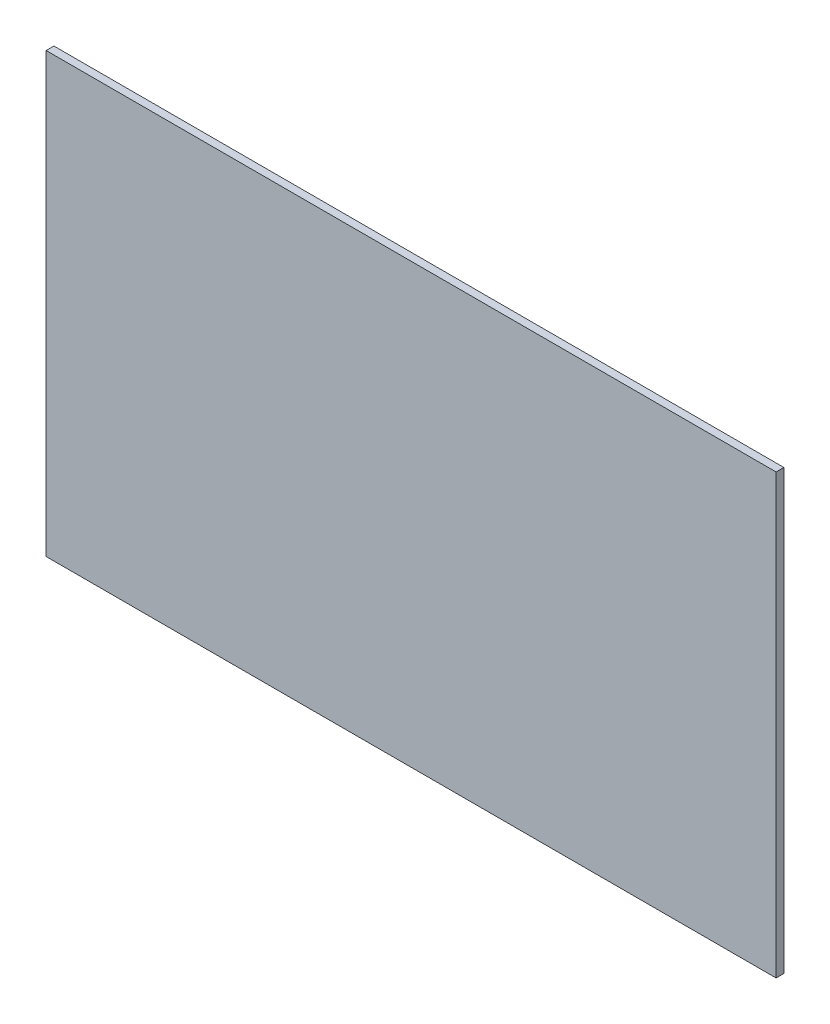
ISO-10303-21;
HEADER;
FILE_DESCRIPTION(('STEP AP214'),'2;1');
FILE_NAME('part.step','',(''),(''),'','','');
FILE_SCHEMA(('AUTOMOTIVE_DESIGN { 1 0 10303 214 1 1 1 1 }'));
ENDSEC;
DATA;
#1=APPLICATION_CONTEXT('core data for automotive mechanical design processes');
#2=APPLICATION_PROTOCOL_DEFINITION('international standard','automotive_design',2000,#1);
#3=PRODUCT_CONTEXT('',#1,'mechanical');
#4=PRODUCT('Part','Part','',(#3));
#5=PRODUCT_RELATED_PRODUCT_CATEGORY('part','',(#4));
#6=PRODUCT_DEFINITION_FORMATION('','',#4);
#7=PRODUCT_DEFINITION_CONTEXT('part definition',#1,'design');
#8=PRODUCT_DEFINITION('design','',#6,#7);
#9=PRODUCT_DEFINITION_SHAPE('','',#8);
#10=(LENGTH_UNIT() NAMED_UNIT(*) SI_UNIT(.MILLI.,.METRE.));
#11=(NAMED_UNIT(*) PLANE_ANGLE_UNIT() SI_UNIT($,.RADIAN.));
#12=(NAMED_UNIT(*) SI_UNIT($,.STERADIAN.) SOLID_ANGLE_UNIT());
#13=UNCERTAINTY_MEASURE_WITH_UNIT(LENGTH_MEASURE(1.E-05),#10,'distance_accuracy_value','');
#14=(GEOMETRIC_REPRESENTATION_CONTEXT(3) GLOBAL_UNCERTAINTY_ASSIGNED_CONTEXT((#13)) GLOBAL_UNIT_ASSIGNED_CONTEXT((#10,
#11,#12)) REPRESENTATION_CONTEXT('',''));
#15=CARTESIAN_POINT('',(0.,0.,0.));
#16=DIRECTION('',(0.,0.,1.));
#17=DIRECTION('',(1.,0.,0.));
#18=AXIS2_PLACEMENT_3D('',#15,#16,#17);
#19=CARTESIAN_POINT('',(563.,338.,12.));
#20=DIRECTION('',(-1.,0.,0.));
#21=DIRECTION('',(0.,-1.,0.));
#22=AXIS2_PLACEMENT_3D('',#19,#20,#21);
#23=PLANE('',#22);
#24=DIRECTION('',(0.,1.,0.));
#25=VECTOR('',#24,1.);
#26=CARTESIAN_POINT('',(563.,338.,0.));
#27=LINE('',#26,#25);
#28=CARTESIAN_POINT('',(563.,-338.,0.));
#29=VERTEX_POINT('',#28);
#30=CARTESIAN_POINT('',(563.,338.,0.));
#31=VERTEX_POINT('',#30);
#32=EDGE_CURVE('E98',#29,#31,#27,.T.);
#33=ORIENTED_EDGE('',*,*,#32,.T.);
#34=DIRECTION('',(0.,0.,-1.));
#35=VECTOR('',#34,1.);
#36=CARTESIAN_POINT('',(563.,338.,12.));
#37=LINE('',#36,#35);
#38=CARTESIAN_POINT('',(563.,338.,12.));
#39=VERTEX_POINT('',#38);
#40=EDGE_CURVE('E11',#39,#31,#37,.T.);
#41=ORIENTED_EDGE('',*,*,#40,.F.);
#42=DIRECTION('',(0.,1.,0.));
#43=VECTOR('',#42,1.);
#44=CARTESIAN_POINT('',(563.,338.,12.));
#45=LINE('',#44,#43);
#46=CARTESIAN_POINT('',(563.,-338.,12.));
#47=VERTEX_POINT('',#46);
#48=EDGE_CURVE('E86',#47,#39,#45,.T.);
#49=ORIENTED_EDGE('',*,*,#48,.F.);
#50=DIRECTION('',(0.,0.,-1.));
#51=VECTOR('',#50,1.);
#52=CARTESIAN_POINT('',(563.,-338.,12.));
#53=LINE('',#52,#51);
#54=EDGE_CURVE('E94',#47,#29,#53,.T.);
#55=ORIENTED_EDGE('',*,*,#54,.T.);
#56=EDGE_LOOP('',(#33,#41,#49,#55));
#57=FACE_BOUND('',#56,.T.);
#58=ADVANCED_FACE('F35',(#57),#23,.F.);
#59=CARTESIAN_POINT('',(-563.,338.,12.));
#60=DIRECTION('',(0.,-1.,0.));
#61=DIRECTION('',(0.,0.,-1.));
#62=AXIS2_PLACEMENT_3D('',#59,#60,#61);
#63=PLANE('',#62);
#64=DIRECTION('',(-1.,0.,0.));
#65=VECTOR('',#64,1.);
#66=CARTESIAN_POINT('',(-563.,338.,0.));
#67=LINE('',#66,#65);
#68=CARTESIAN_POINT('',(-563.,338.,0.));
#69=VERTEX_POINT('',#68);
#70=EDGE_CURVE('E90',#31,#69,#67,.T.);
#71=ORIENTED_EDGE('',*,*,#70,.T.);
#72=DIRECTION('',(0.,0.,-1.));
#73=VECTOR('',#72,1.);
#74=CARTESIAN_POINT('',(-563.,338.,12.));
#75=LINE('',#74,#73);
#76=CARTESIAN_POINT('',(-563.,338.,12.));
#77=VERTEX_POINT('',#76);
#78=EDGE_CURVE('E43',#77,#69,#75,.T.);
#79=ORIENTED_EDGE('',*,*,#78,.F.);
#80=DIRECTION('',(-1.,0.,0.));
#81=VECTOR('',#80,1.);
#82=CARTESIAN_POINT('',(-563.,338.,12.));
#83=LINE('',#82,#81);
#84=EDGE_CURVE('E81',#39,#77,#83,.T.);
#85=ORIENTED_EDGE('',*,*,#84,.F.);
#86=ORIENTED_EDGE('',*,*,#40,.T.);
#87=EDGE_LOOP('',(#71,#79,#85,#86));
#88=FACE_BOUND('',#87,.T.);
#89=ADVANCED_FACE('F89',(#88),#63,.F.);
#90=CARTESIAN_POINT('',(-563.,338.,12.));
#91=DIRECTION('',(1.,0.,0.));
#92=DIRECTION('',(0.,1.,0.));
#93=AXIS2_PLACEMENT_3D('',#90,#91,#92);
#94=PLANE('',#93);
#95=DIRECTION('',(0.,-1.,0.));
#96=VECTOR('',#95,1.);
#97=CARTESIAN_POINT('',(-563.,338.,0.));
#98=LINE('',#97,#96);
#99=CARTESIAN_POINT('',(-563.,-338.,0.));
#100=VERTEX_POINT('',#99);
#101=EDGE_CURVE('E68',#69,#100,#98,.T.);
#102=ORIENTED_EDGE('',*,*,#101,.T.);
#103=DIRECTION('',(0.,0.,-1.));
#104=VECTOR('',#103,1.);
#105=CARTESIAN_POINT('',(-563.,-338.,12.));
#106=LINE('',#105,#104);
#107=CARTESIAN_POINT('',(-563.,-338.,12.));
#108=VERTEX_POINT('',#107);
#109=EDGE_CURVE('E91',#108,#100,#106,.T.);
#110=ORIENTED_EDGE('',*,*,#109,.F.);
#111=DIRECTION('',(0.,-1.,0.));
#112=VECTOR('',#111,1.);
#113=CARTESIAN_POINT('',(-563.,338.,12.));
#114=LINE('',#113,#112);
#115=EDGE_CURVE('E84',#77,#108,#114,.T.);
#116=ORIENTED_EDGE('',*,*,#115,.F.);
#117=ORIENTED_EDGE('',*,*,#78,.T.);
#118=EDGE_LOOP('',(#102,#110,#116,#117));
#119=FACE_BOUND('',#118,.T.);
#120=ADVANCED_FACE('F92',(#119),#94,.F.);
#121=CARTESIAN_POINT('',(-563.,-338.,12.));
#122=DIRECTION('',(0.,1.,0.));
#123=DIRECTION('',(0.,0.,1.));
#124=AXIS2_PLACEMENT_3D('',#121,#122,#123);
#125=PLANE('',#124);
#126=DIRECTION('',(1.,0.,0.));
#127=VECTOR('',#126,1.);
#128=CARTESIAN_POINT('',(-563.,-338.,0.));
#129=LINE('',#128,#127);
#130=EDGE_CURVE('E74',#100,#29,#129,.T.);
#131=ORIENTED_EDGE('',*,*,#130,.T.);
#132=ORIENTED_EDGE('',*,*,#54,.F.);
#133=DIRECTION('',(1.,0.,0.));
#134=VECTOR('',#133,1.);
#135=CARTESIAN_POINT('',(-563.,-338.,12.));
#136=LINE('',#135,#134);
#137=EDGE_CURVE('E51',#108,#47,#136,.T.);
#138=ORIENTED_EDGE('',*,*,#137,.F.);
#139=ORIENTED_EDGE('',*,*,#109,.T.);
#140=EDGE_LOOP('',(#131,#132,#138,#139));
#141=FACE_BOUND('',#140,.T.);
#142=ADVANCED_FACE('F105',(#141),#125,.F.);
#143=CARTESIAN_POINT('',(0.,0.,12.));
#144=DIRECTION('',(0.,0.,1.));
#145=DIRECTION('',(1.,0.,0.));
#146=AXIS2_PLACEMENT_3D('',#143,#144,#145);
#147=PLANE('',#146);
#148=ORIENTED_EDGE('',*,*,#48,.T.);
#149=ORIENTED_EDGE('',*,*,#84,.T.);
#150=ORIENTED_EDGE('',*,*,#115,.T.);
#151=ORIENTED_EDGE('',*,*,#137,.T.);
#152=EDGE_LOOP('',(#148,#149,#150,#151));
#153=FACE_BOUND('',#152,.T.);
#154=ADVANCED_FACE('F82',(#153),#147,.T.);
#155=CARTESIAN_POINT('',(0.,0.,0.));
#156=DIRECTION('',(0.,0.,1.));
#157=DIRECTION('',(1.,0.,0.));
#158=AXIS2_PLACEMENT_3D('',#155,#156,#157);
#159=PLANE('',#158);
#160=ORIENTED_EDGE('',*,*,#32,.F.);
#161=ORIENTED_EDGE('',*,*,#130,.F.);
#162=ORIENTED_EDGE('',*,*,#101,.F.);
#163=ORIENTED_EDGE('',*,*,#70,.F.);
#164=EDGE_LOOP('',(#160,#161,#162,#163));
#165=FACE_BOUND('',#164,.T.);
#166=ADVANCED_FACE('F108',(#165),#159,.F.);
#167=CLOSED_SHELL('',(#58,#89,#120,#142,#154,#166));
#168=MANIFOLD_SOLID_BREP('B2',#167);
#169=ADVANCED_BREP_SHAPE_REPRESENTATION('',(#18,#168),#14);
#170=SHAPE_DEFINITION_REPRESENTATION(#9,#169);
ENDSEC;
END-ISO-10303-21;
